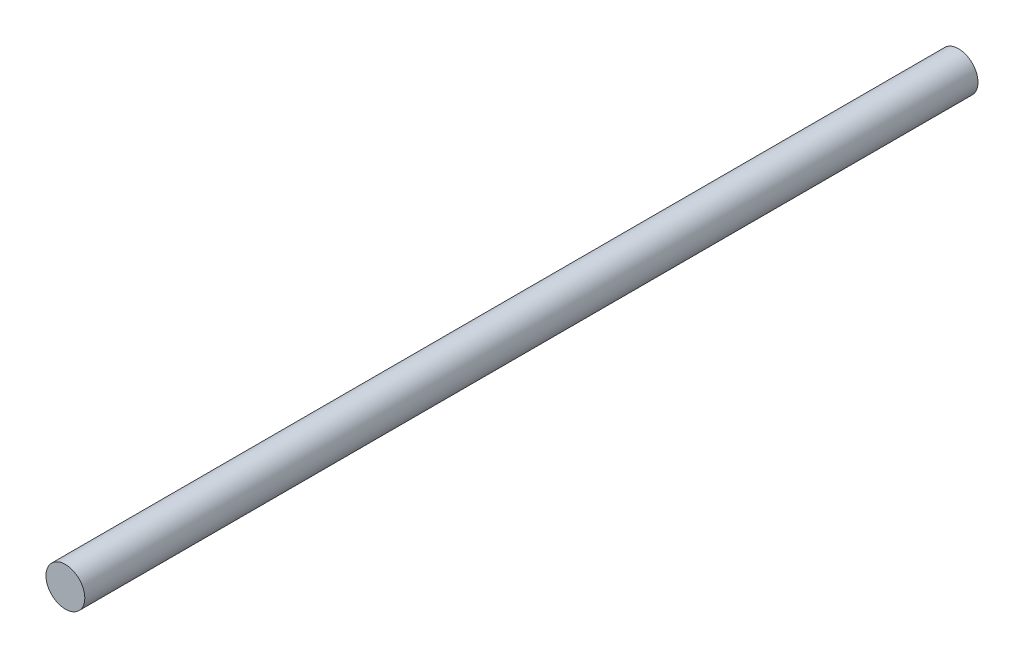
ISO-10303-21;
HEADER;
FILE_DESCRIPTION(('STEP AP214'),'2;1');
FILE_NAME('part.step','',(''),(''),'','','');
FILE_SCHEMA(('AUTOMOTIVE_DESIGN { 1 0 10303 214 1 1 1 1 }'));
ENDSEC;
DATA;
#1=APPLICATION_CONTEXT('core data for automotive mechanical design processes');
#2=APPLICATION_PROTOCOL_DEFINITION('international standard','automotive_design',2000,#1);
#3=PRODUCT_CONTEXT('',#1,'mechanical');
#4=PRODUCT('Part','Part','',(#3));
#5=PRODUCT_RELATED_PRODUCT_CATEGORY('part','',(#4));
#6=PRODUCT_DEFINITION_FORMATION('','',#4);
#7=PRODUCT_DEFINITION_CONTEXT('part definition',#1,'design');
#8=PRODUCT_DEFINITION('design','',#6,#7);
#9=PRODUCT_DEFINITION_SHAPE('','',#8);
#10=(LENGTH_UNIT() NAMED_UNIT(*) SI_UNIT(.MILLI.,.METRE.));
#11=(NAMED_UNIT(*) PLANE_ANGLE_UNIT() SI_UNIT($,.RADIAN.));
#12=(NAMED_UNIT(*) SI_UNIT($,.STERADIAN.) SOLID_ANGLE_UNIT());
#13=UNCERTAINTY_MEASURE_WITH_UNIT(LENGTH_MEASURE(1.E-05),#10,'distance_accuracy_value','');
#14=(GEOMETRIC_REPRESENTATION_CONTEXT(3) GLOBAL_UNCERTAINTY_ASSIGNED_CONTEXT((#13)) GLOBAL_UNIT_ASSIGNED_CONTEXT((#10,
#11,#12)) REPRESENTATION_CONTEXT('',''));
#15=CARTESIAN_POINT('',(0.,0.,0.));
#16=DIRECTION('',(0.,0.,1.));
#17=DIRECTION('',(1.,0.,0.));
#18=AXIS2_PLACEMENT_3D('',#15,#16,#17);
#19=CARTESIAN_POINT('',(0.,0.,146.05));
#20=DIRECTION('',(0.,0.,-1.));
#21=DIRECTION('',(-1.,0.,0.));
#22=AXIS2_PLACEMENT_3D('',#19,#20,#21);
#23=CYLINDRICAL_SURFACE('',#22,6.35);
#24=CARTESIAN_POINT('',(0.,0.,146.05));
#25=DIRECTION('',(0.,0.,1.));
#26=DIRECTION('',(1.,0.,0.));
#27=AXIS2_PLACEMENT_3D('',#24,#25,#26);
#28=CIRCLE('',#27,6.35);
#29=CARTESIAN_POINT('',(6.35,0.,146.05));
#30=VERTEX_POINT('',#29);
#31=EDGE_CURVE('E10',#30,#30,#28,.T.);
#32=ORIENTED_EDGE('',*,*,#31,.F.);
#33=EDGE_LOOP('',(#32));
#34=FACE_BOUND('',#33,.T.);
#35=CARTESIAN_POINT('',(0.,0.,-146.05));
#36=DIRECTION('',(0.,0.,1.));
#37=DIRECTION('',(1.,0.,0.));
#38=AXIS2_PLACEMENT_3D('',#35,#36,#37);
#39=CIRCLE('',#38,6.35);
#40=CARTESIAN_POINT('',(6.35,0.,-146.05));
#41=VERTEX_POINT('',#40);
#42=EDGE_CURVE('E37',#41,#41,#39,.T.);
#43=ORIENTED_EDGE('',*,*,#42,.T.);
#44=EDGE_LOOP('',(#43));
#45=FACE_BOUND('',#44,.T.);
#46=ADVANCED_FACE('F34',(#34,#45),#23,.T.);
#47=CARTESIAN_POINT('',(0.,0.,146.05));
#48=DIRECTION('',(0.,0.,1.));
#49=DIRECTION('',(1.,0.,0.));
#50=AXIS2_PLACEMENT_3D('',#47,#48,#49);
#51=PLANE('',#50);
#52=ORIENTED_EDGE('',*,*,#31,.T.);
#53=EDGE_LOOP('',(#52));
#54=FACE_BOUND('',#53,.T.);
#55=ADVANCED_FACE('F49',(#54),#51,.T.);
#56=CARTESIAN_POINT('',(0.,0.,-146.05));
#57=DIRECTION('',(0.,0.,1.));
#58=DIRECTION('',(1.,0.,0.));
#59=AXIS2_PLACEMENT_3D('',#56,#57,#58);
#60=PLANE('',#59);
#61=ORIENTED_EDGE('',*,*,#42,.F.);
#62=EDGE_LOOP('',(#61));
#63=FACE_BOUND('',#62,.T.);
#64=ADVANCED_FACE('F47',(#63),#60,.F.);
#65=CLOSED_SHELL('',(#46,#55,#64));
#66=MANIFOLD_SOLID_BREP('B2',#65);
#67=ADVANCED_BREP_SHAPE_REPRESENTATION('',(#18,#66),#14);
#68=SHAPE_DEFINITION_REPRESENTATION(#9,#67);
ENDSEC;
END-ISO-10303-21;
